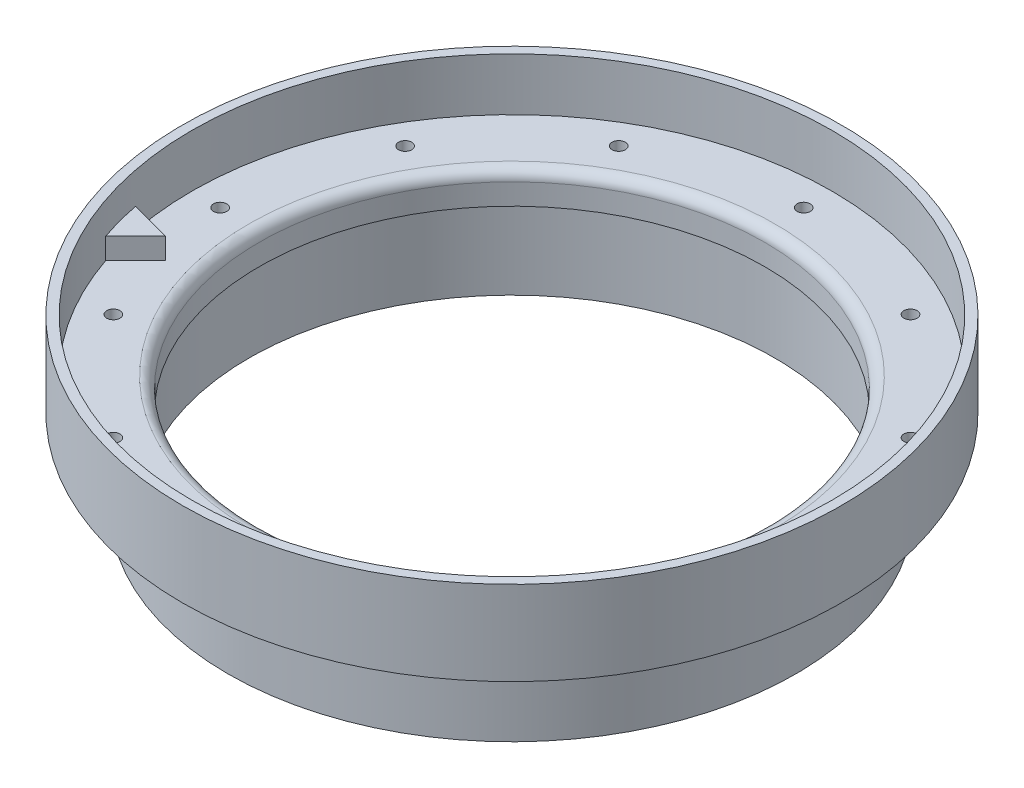
ISO-10303-21;
HEADER;
FILE_DESCRIPTION(('STEP AP214'),'2;1');
FILE_NAME('part.step','',(''),(''),'','','');
FILE_SCHEMA(('AUTOMOTIVE_DESIGN { 1 0 10303 214 1 1 1 1 }'));
ENDSEC;
DATA;
#1=APPLICATION_CONTEXT('core data for automotive mechanical design processes');
#2=APPLICATION_PROTOCOL_DEFINITION('international standard','automotive_design',2000,#1);
#3=PRODUCT_CONTEXT('',#1,'mechanical');
#4=PRODUCT('Part','Part','',(#3));
#5=PRODUCT_RELATED_PRODUCT_CATEGORY('part','',(#4));
#6=PRODUCT_DEFINITION_FORMATION('','',#4);
#7=PRODUCT_DEFINITION_CONTEXT('part definition',#1,'design');
#8=PRODUCT_DEFINITION('design','',#6,#7);
#9=PRODUCT_DEFINITION_SHAPE('','',#8);
#10=(LENGTH_UNIT() NAMED_UNIT(*) SI_UNIT(.MILLI.,.METRE.));
#11=(NAMED_UNIT(*) PLANE_ANGLE_UNIT() SI_UNIT($,.RADIAN.));
#12=(NAMED_UNIT(*) SI_UNIT($,.STERADIAN.) SOLID_ANGLE_UNIT());
#13=UNCERTAINTY_MEASURE_WITH_UNIT(LENGTH_MEASURE(1.E-05),#10,'distance_accuracy_value','');
#14=(GEOMETRIC_REPRESENTATION_CONTEXT(3) GLOBAL_UNCERTAINTY_ASSIGNED_CONTEXT((#13)) GLOBAL_UNIT_ASSIGNED_CONTEXT((#10,
#11,#12)) REPRESENTATION_CONTEXT('',''));
#15=CARTESIAN_POINT('',(0.,0.,0.));
#16=DIRECTION('',(0.,0.,1.));
#17=DIRECTION('',(1.,0.,0.));
#18=AXIS2_PLACEMENT_3D('',#15,#16,#17);
#19=CARTESIAN_POINT('',(0.,55.,0.));
#20=DIRECTION('',(0.,1.,0.));
#21=DIRECTION('',(0.,0.,1.));
#22=AXIS2_PLACEMENT_3D('',#19,#20,#21);
#23=CYLINDRICAL_SURFACE('',#22,48.26);
#24=CARTESIAN_POINT('',(0.,9.525,0.));
#25=DIRECTION('',(0.,1.,0.));
#26=DIRECTION('',(0.,0.,1.));
#27=AXIS2_PLACEMENT_3D('',#24,#25,#26);
#28=CIRCLE('',#27,48.26);
#29=CARTESIAN_POINT('',(0.,9.525,48.26));
#30=VERTEX_POINT('',#29);
#31=EDGE_CURVE('E173',#30,#30,#28,.T.);
#32=ORIENTED_EDGE('',*,*,#31,.T.);
#33=EDGE_LOOP('',(#32));
#34=FACE_BOUND('',#33,.T.);
#35=CARTESIAN_POINT('',(0.,1.5875,0.));
#36=DIRECTION('',(0.,1.,0.));
#37=DIRECTION('',(0.,0.,1.));
#38=AXIS2_PLACEMENT_3D('',#35,#36,#37);
#39=CIRCLE('',#38,48.26);
#40=CARTESIAN_POINT('',(-45.6928384549485,1.5875,15.5303610366912));
#41=VERTEX_POINT('',#40);
#42=CARTESIAN_POINT('',(-47.3363393913495,1.5875,9.3967320397557));
#43=VERTEX_POINT('',#42);
#44=EDGE_CURVE('E85',#41,#43,#39,.T.);
#45=ORIENTED_EDGE('',*,*,#44,.F.);
#46=DIRECTION('',(0.,-1.,0.));
#47=VECTOR('',#46,1.);
#48=CARTESIAN_POINT('',(-45.6928384549485,4.7625,15.5303610366912));
#49=LINE('',#48,#47);
#50=CARTESIAN_POINT('',(-45.6928384549485,4.7625,15.5303610366912));
#51=VERTEX_POINT('',#50);
#52=EDGE_CURVE('E75',#51,#41,#49,.T.);
#53=ORIENTED_EDGE('',*,*,#52,.F.);
#54=CARTESIAN_POINT('',(0.,4.7625,0.));
#55=DIRECTION('',(0.,1.,0.));
#56=DIRECTION('',(0.,0.,-1.));
#57=AXIS2_PLACEMENT_3D('',#54,#55,#56);
#58=CIRCLE('',#57,48.26);
#59=CARTESIAN_POINT('',(-47.3363393913495,4.7625,9.3967320397557));
#60=VERTEX_POINT('',#59);
#61=EDGE_CURVE('E77',#60,#51,#58,.T.);
#62=ORIENTED_EDGE('',*,*,#61,.F.);
#63=DIRECTION('',(0.,-1.,0.));
#64=VECTOR('',#63,1.);
#65=CARTESIAN_POINT('',(-47.3363393913495,4.7625,9.3967320397557));
#66=LINE('',#65,#64);
#67=EDGE_CURVE('E91',#60,#43,#66,.T.);
#68=ORIENTED_EDGE('',*,*,#67,.T.);
#69=EDGE_LOOP('',(#45,#53,#62,#68));
#70=FACE_BOUND('',#69,.T.);
#71=ADVANCED_FACE('F35',(#34,#70),#23,.F.);
#72=CARTESIAN_POINT('',(-39.6875,1.5875,0.));
#73=DIRECTION('',(0.,1.,0.));
#74=DIRECTION('',(0.,0.,1.));
#75=AXIS2_PLACEMENT_3D('',#72,#73,#74);
#76=PLANE('',#75);
#77=CARTESIAN_POINT('',(-38.0823845996807,1.58750000000002,-21.9868749999744));
#78=DIRECTION('',(0.,1.,0.));
#79=DIRECTION('',(0.,0.,1.));
#80=AXIS2_PLACEMENT_3D('',#77,#78,#79);
#81=CIRCLE('',#80,0.996949999999996);
#82=CARTESIAN_POINT('',(-38.0823845996807,1.58750000000002,-20.9899249999744));
#83=VERTEX_POINT('',#82);
#84=EDGE_CURVE('E86',#83,#83,#81,.T.);
#85=ORIENTED_EDGE('',*,*,#84,.F.);
#86=EDGE_LOOP('',(#85));
#87=FACE_BOUND('',#86,.T.);
#88=CARTESIAN_POINT('',(-21.9868750000255,1.58750000000007,-38.0823845996512));
#89=DIRECTION('',(0.,1.,0.));
#90=DIRECTION('',(0.,0.,1.));
#91=AXIS2_PLACEMENT_3D('',#88,#89,#90);
#92=CIRCLE('',#91,0.996949999999996);
#93=CARTESIAN_POINT('',(-21.9868750000255,1.58750000000007,-37.0854345996512));
#94=VERTEX_POINT('',#93);
#95=EDGE_CURVE('E97',#94,#94,#92,.T.);
#96=ORIENTED_EDGE('',*,*,#95,.F.);
#97=EDGE_LOOP('',(#96));
#98=FACE_BOUND('',#97,.T.);
#99=CARTESIAN_POINT('',(-2.94188747273289E-11,1.58750000000015,-43.97375));
#100=DIRECTION('',(0.,1.,0.));
#101=DIRECTION('',(0.,0.,1.));
#102=AXIS2_PLACEMENT_3D('',#99,#100,#101);
#103=CIRCLE('',#102,0.996949999999998);
#104=CARTESIAN_POINT('',(-2.94188747273289E-11,1.58750000000015,-42.9768));
#105=VERTEX_POINT('',#104);
#106=EDGE_CURVE('E103',#105,#105,#103,.T.);
#107=ORIENTED_EDGE('',*,*,#106,.F.);
#108=EDGE_LOOP('',(#107));
#109=FACE_BOUND('',#108,.T.);
#110=CARTESIAN_POINT('',(21.9868749999745,1.58750000000023,-38.0823845996806));
#111=DIRECTION('',(0.,1.,0.));
#112=DIRECTION('',(0.,0.,1.));
#113=AXIS2_PLACEMENT_3D('',#110,#111,#112);
#114=CIRCLE('',#113,0.996949999999996);
#115=CARTESIAN_POINT('',(21.9868749999745,1.58750000000023,-37.0854345996806));
#116=VERTEX_POINT('',#115);
#117=EDGE_CURVE('E109',#116,#116,#114,.T.);
#118=ORIENTED_EDGE('',*,*,#117,.F.);
#119=EDGE_LOOP('',(#118));
#120=FACE_BOUND('',#119,.T.);
#121=CARTESIAN_POINT('',(38.0823845996513,1.58750000000028,-21.9868750000254));
#122=DIRECTION('',(0.,1.,0.));
#123=DIRECTION('',(0.,0.,1.));
#124=AXIS2_PLACEMENT_3D('',#121,#122,#123);
#125=CIRCLE('',#124,0.996949999999996);
#126=CARTESIAN_POINT('',(38.0823845996513,1.58750000000028,-20.9899250000254));
#127=VERTEX_POINT('',#126);
#128=EDGE_CURVE('E115',#127,#127,#125,.T.);
#129=ORIENTED_EDGE('',*,*,#128,.F.);
#130=EDGE_LOOP('',(#129));
#131=FACE_BOUND('',#130,.T.);
#132=CARTESIAN_POINT('',(43.97375,1.58750000000031,-2.89527314181316E-11));
#133=DIRECTION('',(0.,1.,0.));
#134=DIRECTION('',(0.,0.,1.));
#135=AXIS2_PLACEMENT_3D('',#132,#133,#134);
#136=CIRCLE('',#135,0.996949999999996);
#137=CARTESIAN_POINT('',(43.97375,1.58750000000031,0.996949999971044));
#138=VERTEX_POINT('',#137);
#139=EDGE_CURVE('E121',#138,#138,#136,.T.);
#140=ORIENTED_EDGE('',*,*,#139,.F.);
#141=EDGE_LOOP('',(#140));
#142=FACE_BOUND('',#141,.T.);
#143=CARTESIAN_POINT('',(38.0823845996805,1.58750000000028,21.9868749999747));
#144=DIRECTION('',(0.,1.,0.));
#145=DIRECTION('',(0.,0.,1.));
#146=AXIS2_PLACEMENT_3D('',#143,#144,#145);
#147=CIRCLE('',#146,0.996949999999996);
#148=CARTESIAN_POINT('',(38.0823845996805,1.58750000000029,22.9838249999747));
#149=VERTEX_POINT('',#148);
#150=EDGE_CURVE('E127',#149,#149,#147,.T.);
#151=ORIENTED_EDGE('',*,*,#150,.F.);
#152=EDGE_LOOP('',(#151));
#153=FACE_BOUND('',#152,.T.);
#154=CARTESIAN_POINT('',(21.9868750000252,1.58750000000023,38.0823845996514));
#155=DIRECTION('',(0.,1.,0.));
#156=DIRECTION('',(0.,0.,1.));
#157=AXIS2_PLACEMENT_3D('',#154,#155,#156);
#158=CIRCLE('',#157,0.996949999999996);
#159=CARTESIAN_POINT('',(21.9868750000252,1.58750000000023,39.0793345996514));
#160=VERTEX_POINT('',#159);
#161=EDGE_CURVE('E133',#160,#160,#158,.T.);
#162=ORIENTED_EDGE('',*,*,#161,.F.);
#163=EDGE_LOOP('',(#162));
#164=FACE_BOUND('',#163,.T.);
#165=CARTESIAN_POINT('',(2.91007222190302E-11,1.58750000000015,43.97375));
#166=DIRECTION('',(0.,1.,0.));
#167=DIRECTION('',(0.,0.,1.));
#168=AXIS2_PLACEMENT_3D('',#165,#166,#167);
#169=CIRCLE('',#168,0.996949999999998);
#170=CARTESIAN_POINT('',(2.91007222190302E-11,1.58750000000015,44.9707));
#171=VERTEX_POINT('',#170);
#172=EDGE_CURVE('E139',#171,#171,#169,.T.);
#173=ORIENTED_EDGE('',*,*,#172,.F.);
#174=EDGE_LOOP('',(#173));
#175=FACE_BOUND('',#174,.T.);
#176=CARTESIAN_POINT('',(-21.9868749999748,1.58750000000007,38.0823845996805));
#177=DIRECTION('',(0.,1.,0.));
#178=DIRECTION('',(0.,0.,1.));
#179=AXIS2_PLACEMENT_3D('',#176,#177,#178);
#180=CIRCLE('',#179,0.996949999999996);
#181=CARTESIAN_POINT('',(-21.9868749999748,1.58750000000008,39.0793345996805));
#182=VERTEX_POINT('',#181);
#183=EDGE_CURVE('E145',#182,#182,#180,.T.);
#184=ORIENTED_EDGE('',*,*,#183,.F.);
#185=EDGE_LOOP('',(#184));
#186=FACE_BOUND('',#185,.T.);
#187=CARTESIAN_POINT('',(-38.0823845996514,1.58750000000002,21.9868750000251));
#188=DIRECTION('',(0.,1.,0.));
#189=DIRECTION('',(0.,0.,1.));
#190=AXIS2_PLACEMENT_3D('',#187,#188,#189);
#191=CIRCLE('',#190,0.996949999999996);
#192=CARTESIAN_POINT('',(-38.0823845996514,1.58750000000002,22.9838250000251));
#193=VERTEX_POINT('',#192);
#194=EDGE_CURVE('E151',#193,#193,#191,.T.);
#195=ORIENTED_EDGE('',*,*,#194,.F.);
#196=EDGE_LOOP('',(#195));
#197=FACE_BOUND('',#196,.T.);
#198=CARTESIAN_POINT('',(-43.97375,1.5875,2.89527314181316E-11));
#199=DIRECTION('',(0.,1.,0.));
#200=DIRECTION('',(0.,0.,1.));
#201=AXIS2_PLACEMENT_3D('',#198,#199,#200);
#202=CIRCLE('',#201,0.996949999999996);
#203=CARTESIAN_POINT('',(-43.97375,1.5875,0.996950000028949));
#204=VERTEX_POINT('',#203);
#205=EDGE_CURVE('E157',#204,#204,#202,.T.);
#206=ORIENTED_EDGE('',*,*,#205,.F.);
#207=EDGE_LOOP('',(#206));
#208=FACE_BOUND('',#207,.T.);
#209=CARTESIAN_POINT('',(0.,1.5875,0.));
#210=DIRECTION('',(0.,1.,0.));
#211=DIRECTION('',(0.,0.,1.));
#212=AXIS2_PLACEMENT_3D('',#209,#210,#211);
#213=CIRCLE('',#212,39.6875);
#214=CARTESIAN_POINT('',(0.,1.5875,39.6875));
#215=VERTEX_POINT('',#214);
#216=EDGE_CURVE('E169',#215,#215,#213,.T.);
#217=ORIENTED_EDGE('',*,*,#216,.F.);
#218=EDGE_LOOP('',(#217));
#219=FACE_BOUND('',#218,.T.);
#220=DIRECTION('',(-0.965925826289069,0.,-0.258819045102517));
#221=VECTOR('',#220,1.);
#222=CARTESIAN_POINT('',(-41.2027103944139,1.5875,11.0402329761567));
#223=LINE('',#222,#221);
#224=CARTESIAN_POINT('',(-41.2027103944139,1.5875,11.0402329761567));
#225=VERTEX_POINT('',#224);
#226=EDGE_CURVE('E68',#225,#43,#223,.T.);
#227=ORIENTED_EDGE('',*,*,#226,.F.);
#228=DIRECTION('',(0.707106781186549,0.,-0.707106781186546));
#229=VECTOR('',#228,1.);
#230=CARTESIAN_POINT('',(-45.6928384549485,1.5875,15.5303610366912));
#231=LINE('',#230,#229);
#232=EDGE_CURVE('E504',#41,#225,#231,.T.);
#233=ORIENTED_EDGE('',*,*,#232,.F.);
#234=ORIENTED_EDGE('',*,*,#44,.T.);
#235=EDGE_LOOP('',(#227,#233,#234));
#236=FACE_BOUND('',#235,.T.);
#237=ADVANCED_FACE('F202',(#87,#98,#109,#120,#131,#142,#153,#164,#175,#186,#197,#208,#219,#236),
#76,.T.);
#238=CARTESIAN_POINT('',(-38.1,-3.175,0.));
#239=DIRECTION('',(0.,-1.,0.));
#240=DIRECTION('',(0.,0.,-1.));
#241=AXIS2_PLACEMENT_3D('',#238,#239,#240);
#242=PLANE('',#241);
#243=CARTESIAN_POINT('',(0.,-3.175,0.));
#244=DIRECTION('',(0.,1.,0.));
#245=DIRECTION('',(0.,0.,1.));
#246=AXIS2_PLACEMENT_3D('',#243,#244,#245);
#247=CIRCLE('',#246,38.1);
#248=CARTESIAN_POINT('',(0.,-3.175,38.1));
#249=VERTEX_POINT('',#248);
#250=EDGE_CURVE('E163',#249,#249,#247,.T.);
#251=ORIENTED_EDGE('',*,*,#250,.T.);
#252=EDGE_LOOP('',(#251));
#253=FACE_BOUND('',#252,.T.);
#254=CARTESIAN_POINT('',(0.,-3.175,0.));
#255=DIRECTION('',(0.,1.,0.));
#256=DIRECTION('',(0.,0.,1.));
#257=AXIS2_PLACEMENT_3D('',#254,#255,#256);
#258=CIRCLE('',#257,39.6367);
#259=CARTESIAN_POINT('',(0.,-3.175,39.6367));
#260=VERTEX_POINT('',#259);
#261=EDGE_CURVE('E11',#260,#260,#258,.T.);
#262=ORIENTED_EDGE('',*,*,#261,.F.);
#263=EDGE_LOOP('',(#262));
#264=FACE_BOUND('',#263,.T.);
#265=ADVANCED_FACE('F37',(#253,#264),#242,.T.);
#266=CARTESIAN_POINT('',(0.,55.,0.));
#267=DIRECTION('',(0.,1.,0.));
#268=DIRECTION('',(0.,0.,1.));
#269=AXIS2_PLACEMENT_3D('',#266,#267,#268);
#270=CYLINDRICAL_SURFACE('',#269,39.6367);
#271=ORIENTED_EDGE('',*,*,#261,.T.);
#272=EDGE_LOOP('',(#271));
#273=FACE_BOUND('',#272,.T.);
#274=CARTESIAN_POINT('',(0.,-15.875,0.));
#275=DIRECTION('',(0.,1.,0.));
#276=DIRECTION('',(0.,0.,1.));
#277=AXIS2_PLACEMENT_3D('',#274,#275,#276);
#278=CIRCLE('',#277,39.6367);
#279=CARTESIAN_POINT('',(0.,-15.875,39.6367));
#280=VERTEX_POINT('',#279);
#281=EDGE_CURVE('E43',#280,#280,#278,.T.);
#282=ORIENTED_EDGE('',*,*,#281,.F.);
#283=EDGE_LOOP('',(#282));
#284=FACE_BOUND('',#283,.T.);
#285=ADVANCED_FACE('F193',(#273,#284),#270,.F.);
#286=CARTESIAN_POINT('',(-42.8117,-15.875,0.));
#287=DIRECTION('',(0.,-1.,0.));
#288=DIRECTION('',(0.,0.,-1.));
#289=AXIS2_PLACEMENT_3D('',#286,#287,#288);
#290=PLANE('',#289);
#291=ORIENTED_EDGE('',*,*,#281,.T.);
#292=EDGE_LOOP('',(#291));
#293=FACE_BOUND('',#292,.T.);
#294=CARTESIAN_POINT('',(0.,-15.875,0.));
#295=DIRECTION('',(0.,1.,0.));
#296=DIRECTION('',(0.,0.,1.));
#297=AXIS2_PLACEMENT_3D('',#294,#295,#296);
#298=CIRCLE('',#297,42.8117);
#299=CARTESIAN_POINT('',(0.,-15.875,42.8117));
#300=VERTEX_POINT('',#299);
#301=EDGE_CURVE('E185',#300,#300,#298,.T.);
#302=ORIENTED_EDGE('',*,*,#301,.F.);
#303=EDGE_LOOP('',(#302));
#304=FACE_BOUND('',#303,.T.);
#305=ADVANCED_FACE('F190',(#293,#304),#290,.T.);
#306=CARTESIAN_POINT('',(0.,55.,0.));
#307=DIRECTION('',(0.,1.,0.));
#308=DIRECTION('',(0.,0.,1.));
#309=AXIS2_PLACEMENT_3D('',#306,#307,#308);
#310=CYLINDRICAL_SURFACE('',#309,42.8117);
#311=ORIENTED_EDGE('',*,*,#301,.T.);
#312=EDGE_LOOP('',(#311));
#313=FACE_BOUND('',#312,.T.);
#314=CARTESIAN_POINT('',(0.,-3.175,0.));
#315=DIRECTION('',(0.,1.,0.));
#316=DIRECTION('',(0.,0.,1.));
#317=AXIS2_PLACEMENT_3D('',#314,#315,#316);
#318=CIRCLE('',#317,42.8117);
#319=CARTESIAN_POINT('',(0.,-3.175,42.8117));
#320=VERTEX_POINT('',#319);
#321=EDGE_CURVE('E182',#320,#320,#318,.T.);
#322=ORIENTED_EDGE('',*,*,#321,.F.);
#323=EDGE_LOOP('',(#322));
#324=FACE_BOUND('',#323,.T.);
#325=ADVANCED_FACE('F200',(#313,#324),#310,.T.);
#326=CARTESIAN_POINT('',(-42.8117,-3.175,0.));
#327=DIRECTION('',(0.,-1.,0.));
#328=DIRECTION('',(0.,0.,-1.));
#329=AXIS2_PLACEMENT_3D('',#326,#327,#328);
#330=PLANE('',#329);
#331=CARTESIAN_POINT('',(-38.0823845996807,-3.175,-21.9868749999744));
#332=DIRECTION('',(0.,-1.,0.));
#333=DIRECTION('',(0.,0.,-1.));
#334=AXIS2_PLACEMENT_3D('',#331,#332,#333);
#335=CIRCLE('',#334,0.996949999999996);
#336=CARTESIAN_POINT('',(-38.0823845996807,-3.175,-22.9838249999744));
#337=VERTEX_POINT('',#336);
#338=EDGE_CURVE('E89',#337,#337,#335,.T.);
#339=ORIENTED_EDGE('',*,*,#338,.F.);
#340=EDGE_LOOP('',(#339));
#341=FACE_BOUND('',#340,.T.);
#342=CARTESIAN_POINT('',(-21.9868750000255,-3.175,-38.0823845996512));
#343=DIRECTION('',(0.,-1.,0.));
#344=DIRECTION('',(0.,0.,-1.));
#345=AXIS2_PLACEMENT_3D('',#342,#343,#344);
#346=CIRCLE('',#345,0.996949999999996);
#347=CARTESIAN_POINT('',(-21.9868750000255,-3.175,-39.0793345996512));
#348=VERTEX_POINT('',#347);
#349=EDGE_CURVE('E100',#348,#348,#346,.T.);
#350=ORIENTED_EDGE('',*,*,#349,.F.);
#351=EDGE_LOOP('',(#350));
#352=FACE_BOUND('',#351,.T.);
#353=CARTESIAN_POINT('',(-2.94188747273289E-11,-3.175,-43.97375));
#354=DIRECTION('',(0.,-1.,0.));
#355=DIRECTION('',(0.,0.,-1.));
#356=AXIS2_PLACEMENT_3D('',#353,#354,#355);
#357=CIRCLE('',#356,0.996949999999996);
#358=CARTESIAN_POINT('',(-2.94188747273289E-11,-3.175,-44.9707));
#359=VERTEX_POINT('',#358);
#360=EDGE_CURVE('E106',#359,#359,#357,.T.);
#361=ORIENTED_EDGE('',*,*,#360,.F.);
#362=EDGE_LOOP('',(#361));
#363=FACE_BOUND('',#362,.T.);
#364=CARTESIAN_POINT('',(21.9868749999745,-3.175,-38.0823845996806));
#365=DIRECTION('',(0.,-1.,0.));
#366=DIRECTION('',(0.,0.,-1.));
#367=AXIS2_PLACEMENT_3D('',#364,#365,#366);
#368=CIRCLE('',#367,0.996949999999996);
#369=CARTESIAN_POINT('',(21.9868749999745,-3.175,-39.0793345996806));
#370=VERTEX_POINT('',#369);
#371=EDGE_CURVE('E112',#370,#370,#368,.T.);
#372=ORIENTED_EDGE('',*,*,#371,.F.);
#373=EDGE_LOOP('',(#372));
#374=FACE_BOUND('',#373,.T.);
#375=CARTESIAN_POINT('',(38.0823845996513,-3.175,-21.9868750000254));
#376=DIRECTION('',(0.,-1.,0.));
#377=DIRECTION('',(0.,0.,-1.));
#378=AXIS2_PLACEMENT_3D('',#375,#376,#377);
#379=CIRCLE('',#378,0.996949999999996);
#380=CARTESIAN_POINT('',(38.0823845996513,-3.175,-22.9838250000254));
#381=VERTEX_POINT('',#380);
#382=EDGE_CURVE('E118',#381,#381,#379,.T.);
#383=ORIENTED_EDGE('',*,*,#382,.F.);
#384=EDGE_LOOP('',(#383));
#385=FACE_BOUND('',#384,.T.);
#386=CARTESIAN_POINT('',(43.97375,-3.175,-2.89527314181316E-11));
#387=DIRECTION('',(0.,-1.,0.));
#388=DIRECTION('',(0.,0.,-1.));
#389=AXIS2_PLACEMENT_3D('',#386,#387,#388);
#390=CIRCLE('',#389,0.996949999999996);
#391=CARTESIAN_POINT('',(43.97375,-3.175,-0.996950000028949));
#392=VERTEX_POINT('',#391);
#393=EDGE_CURVE('E124',#392,#392,#390,.T.);
#394=ORIENTED_EDGE('',*,*,#393,.F.);
#395=EDGE_LOOP('',(#394));
#396=FACE_BOUND('',#395,.T.);
#397=CARTESIAN_POINT('',(38.0823845996805,-3.175,21.9868749999747));
#398=DIRECTION('',(0.,-1.,0.));
#399=DIRECTION('',(0.,0.,-1.));
#400=AXIS2_PLACEMENT_3D('',#397,#398,#399);
#401=CIRCLE('',#400,0.996949999999996);
#402=CARTESIAN_POINT('',(38.0823845996805,-3.175,20.9899249999747));
#403=VERTEX_POINT('',#402);
#404=EDGE_CURVE('E130',#403,#403,#401,.T.);
#405=ORIENTED_EDGE('',*,*,#404,.F.);
#406=EDGE_LOOP('',(#405));
#407=FACE_BOUND('',#406,.T.);
#408=CARTESIAN_POINT('',(21.9868750000252,-3.175,38.0823845996514));
#409=DIRECTION('',(0.,-1.,0.));
#410=DIRECTION('',(0.,0.,-1.));
#411=AXIS2_PLACEMENT_3D('',#408,#409,#410);
#412=CIRCLE('',#411,0.996949999999996);
#413=CARTESIAN_POINT('',(21.9868750000252,-3.175,37.0854345996514));
#414=VERTEX_POINT('',#413);
#415=EDGE_CURVE('E136',#414,#414,#412,.T.);
#416=ORIENTED_EDGE('',*,*,#415,.F.);
#417=EDGE_LOOP('',(#416));
#418=FACE_BOUND('',#417,.T.);
#419=CARTESIAN_POINT('',(2.91007222190302E-11,-3.175,43.97375));
#420=DIRECTION('',(0.,-1.,0.));
#421=DIRECTION('',(0.,0.,-1.));
#422=AXIS2_PLACEMENT_3D('',#419,#420,#421);
#423=CIRCLE('',#422,0.996949999999996);
#424=CARTESIAN_POINT('',(2.91007222190302E-11,-3.175,42.9768));
#425=VERTEX_POINT('',#424);
#426=EDGE_CURVE('E142',#425,#425,#423,.T.);
#427=ORIENTED_EDGE('',*,*,#426,.F.);
#428=EDGE_LOOP('',(#427));
#429=FACE_BOUND('',#428,.T.);
#430=CARTESIAN_POINT('',(-21.9868749999748,-3.175,38.0823845996805));
#431=DIRECTION('',(0.,-1.,0.));
#432=DIRECTION('',(0.,0.,-1.));
#433=AXIS2_PLACEMENT_3D('',#430,#431,#432);
#434=CIRCLE('',#433,0.996949999999996);
#435=CARTESIAN_POINT('',(-21.9868749999748,-3.175,37.0854345996805));
#436=VERTEX_POINT('',#435);
#437=EDGE_CURVE('E148',#436,#436,#434,.T.);
#438=ORIENTED_EDGE('',*,*,#437,.F.);
#439=EDGE_LOOP('',(#438));
#440=FACE_BOUND('',#439,.T.);
#441=CARTESIAN_POINT('',(-38.0823845996514,-3.175,21.9868750000251));
#442=DIRECTION('',(0.,-1.,0.));
#443=DIRECTION('',(0.,0.,-1.));
#444=AXIS2_PLACEMENT_3D('',#441,#442,#443);
#445=CIRCLE('',#444,0.996949999999996);
#446=CARTESIAN_POINT('',(-38.0823845996514,-3.175,20.9899250000251));
#447=VERTEX_POINT('',#446);
#448=EDGE_CURVE('E154',#447,#447,#445,.T.);
#449=ORIENTED_EDGE('',*,*,#448,.F.);
#450=EDGE_LOOP('',(#449));
#451=FACE_BOUND('',#450,.T.);
#452=CARTESIAN_POINT('',(-43.97375,-3.175,2.89527314181316E-11));
#453=DIRECTION('',(0.,-1.,0.));
#454=DIRECTION('',(0.,0.,-1.));
#455=AXIS2_PLACEMENT_3D('',#452,#453,#454);
#456=CIRCLE('',#455,0.996949999999996);
#457=CARTESIAN_POINT('',(-43.97375,-3.175,-0.996949999971044));
#458=VERTEX_POINT('',#457);
#459=EDGE_CURVE('E160',#458,#458,#456,.T.);
#460=ORIENTED_EDGE('',*,*,#459,.F.);
#461=EDGE_LOOP('',(#460));
#462=FACE_BOUND('',#461,.T.);
#463=ORIENTED_EDGE('',*,*,#321,.T.);
#464=EDGE_LOOP('',(#463));
#465=FACE_BOUND('',#464,.T.);
#466=CARTESIAN_POINT('',(0.,-3.175,0.));
#467=DIRECTION('',(0.,1.,0.));
#468=DIRECTION('',(0.,0.,1.));
#469=AXIS2_PLACEMENT_3D('',#466,#467,#468);
#470=CIRCLE('',#469,49.6697);
#471=CARTESIAN_POINT('',(0.,-3.175,49.6697));
#472=VERTEX_POINT('',#471);
#473=EDGE_CURVE('E179',#472,#472,#470,.T.);
#474=ORIENTED_EDGE('',*,*,#473,.F.);
#475=EDGE_LOOP('',(#474));
#476=FACE_BOUND('',#475,.T.);
#477=ADVANCED_FACE('F222',(#341,#352,#363,#374,#385,#396,#407,#418,#429,#440,#451,#462,#465,
#476),#330,.T.);
#478=CARTESIAN_POINT('',(0.,55.,0.));
#479=DIRECTION('',(0.,1.,0.));
#480=DIRECTION('',(0.,0.,1.));
#481=AXIS2_PLACEMENT_3D('',#478,#479,#480);
#482=CYLINDRICAL_SURFACE('',#481,49.6697);
#483=ORIENTED_EDGE('',*,*,#473,.T.);
#484=EDGE_LOOP('',(#483));
#485=FACE_BOUND('',#484,.T.);
#486=CARTESIAN_POINT('',(0.,9.525,0.));
#487=DIRECTION('',(0.,1.,0.));
#488=DIRECTION('',(0.,0.,1.));
#489=AXIS2_PLACEMENT_3D('',#486,#487,#488);
#490=CIRCLE('',#489,49.6697);
#491=CARTESIAN_POINT('',(0.,9.525,49.6697));
#492=VERTEX_POINT('',#491);
#493=EDGE_CURVE('E176',#492,#492,#490,.T.);
#494=ORIENTED_EDGE('',*,*,#493,.F.);
#495=EDGE_LOOP('',(#494));
#496=FACE_BOUND('',#495,.T.);
#497=ADVANCED_FACE('F218',(#485,#496),#482,.T.);
#498=CARTESIAN_POINT('',(-49.6697,9.525,0.));
#499=DIRECTION('',(0.,1.,0.));
#500=DIRECTION('',(0.,0.,1.));
#501=AXIS2_PLACEMENT_3D('',#498,#499,#500);
#502=PLANE('',#501);
#503=ORIENTED_EDGE('',*,*,#493,.T.);
#504=EDGE_LOOP('',(#503));
#505=FACE_BOUND('',#504,.T.);
#506=ORIENTED_EDGE('',*,*,#31,.F.);
#507=EDGE_LOOP('',(#506));
#508=FACE_BOUND('',#507,.T.);
#509=ADVANCED_FACE('F214',(#505,#508),#502,.T.);
#510=CARTESIAN_POINT('',(0.,0.,0.));
#511=DIRECTION('',(0.,1.,0.));
#512=DIRECTION('',(0.,0.,1.));
#513=AXIS2_PLACEMENT_3D('',#510,#511,#512);
#514=TOROIDAL_SURFACE('',#513,39.6875,1.5875);
#515=ORIENTED_EDGE('',*,*,#216,.T.);
#516=EDGE_LOOP('',(#515));
#517=FACE_BOUND('',#516,.T.);
#518=CARTESIAN_POINT('',(0.,0.,0.));
#519=DIRECTION('',(0.,1.,0.));
#520=DIRECTION('',(0.,0.,1.));
#521=AXIS2_PLACEMENT_3D('',#518,#519,#520);
#522=CIRCLE('',#521,38.1);
#523=CARTESIAN_POINT('',(0.,0.,38.1));
#524=VERTEX_POINT('',#523);
#525=EDGE_CURVE('E166',#524,#524,#522,.T.);
#526=ORIENTED_EDGE('',*,*,#525,.F.);
#527=EDGE_LOOP('',(#526));
#528=FACE_BOUND('',#527,.T.);
#529=ADVANCED_FACE('F217',(#517,#528),#514,.T.);
#530=CARTESIAN_POINT('',(0.,55.,0.));
#531=DIRECTION('',(0.,1.,0.));
#532=DIRECTION('',(0.,0.,1.));
#533=AXIS2_PLACEMENT_3D('',#530,#531,#532);
#534=CYLINDRICAL_SURFACE('',#533,38.1);
#535=ORIENTED_EDGE('',*,*,#525,.T.);
#536=EDGE_LOOP('',(#535));
#537=FACE_BOUND('',#536,.T.);
#538=ORIENTED_EDGE('',*,*,#250,.F.);
#539=EDGE_LOOP('',(#538));
#540=FACE_BOUND('',#539,.T.);
#541=ADVANCED_FACE('F263',(#537,#540),#534,.F.);
#542=CARTESIAN_POINT('',(-43.97375,1.5875,2.89527314181316E-11));
#543=DIRECTION('',(0.,1.,0.));
#544=DIRECTION('',(0.,0.,1.));
#545=AXIS2_PLACEMENT_3D('',#542,#543,#544);
#546=CYLINDRICAL_SURFACE('',#545,0.996949999999996);
#547=ORIENTED_EDGE('',*,*,#459,.T.);
#548=EDGE_LOOP('',(#547));
#549=FACE_BOUND('',#548,.T.);
#550=ORIENTED_EDGE('',*,*,#205,.T.);
#551=EDGE_LOOP('',(#550));
#552=FACE_BOUND('',#551,.T.);
#553=ADVANCED_FACE('F270',(#549,#552),#546,.F.);
#554=CARTESIAN_POINT('',(-38.0823845996514,1.58750000000002,21.9868750000251));
#555=DIRECTION('',(0.,1.,0.));
#556=DIRECTION('',(0.,0.,1.));
#557=AXIS2_PLACEMENT_3D('',#554,#555,#556);
#558=CYLINDRICAL_SURFACE('',#557,0.996949999999996);
#559=ORIENTED_EDGE('',*,*,#448,.T.);
#560=EDGE_LOOP('',(#559));
#561=FACE_BOUND('',#560,.T.);
#562=ORIENTED_EDGE('',*,*,#194,.T.);
#563=EDGE_LOOP('',(#562));
#564=FACE_BOUND('',#563,.T.);
#565=ADVANCED_FACE('F278',(#561,#564),#558,.F.);
#566=CARTESIAN_POINT('',(-21.9868749999748,1.58750000000007,38.0823845996805));
#567=DIRECTION('',(0.,1.,0.));
#568=DIRECTION('',(0.,0.,1.));
#569=AXIS2_PLACEMENT_3D('',#566,#567,#568);
#570=CYLINDRICAL_SURFACE('',#569,0.996949999999996);
#571=ORIENTED_EDGE('',*,*,#437,.T.);
#572=EDGE_LOOP('',(#571));
#573=FACE_BOUND('',#572,.T.);
#574=ORIENTED_EDGE('',*,*,#183,.T.);
#575=EDGE_LOOP('',(#574));
#576=FACE_BOUND('',#575,.T.);
#577=ADVANCED_FACE('F286',(#573,#576),#570,.F.);
#578=CARTESIAN_POINT('',(2.91007222190302E-11,1.58750000000015,43.97375));
#579=DIRECTION('',(0.,1.,0.));
#580=DIRECTION('',(0.,0.,1.));
#581=AXIS2_PLACEMENT_3D('',#578,#579,#580);
#582=CYLINDRICAL_SURFACE('',#581,0.996949999999996);
#583=ORIENTED_EDGE('',*,*,#426,.T.);
#584=EDGE_LOOP('',(#583));
#585=FACE_BOUND('',#584,.T.);
#586=ORIENTED_EDGE('',*,*,#172,.T.);
#587=EDGE_LOOP('',(#586));
#588=FACE_BOUND('',#587,.T.);
#589=ADVANCED_FACE('F294',(#585,#588),#582,.F.);
#590=CARTESIAN_POINT('',(21.9868750000252,1.58750000000023,38.0823845996514));
#591=DIRECTION('',(0.,1.,0.));
#592=DIRECTION('',(0.,0.,1.));
#593=AXIS2_PLACEMENT_3D('',#590,#591,#592);
#594=CYLINDRICAL_SURFACE('',#593,0.996949999999996);
#595=ORIENTED_EDGE('',*,*,#415,.T.);
#596=EDGE_LOOP('',(#595));
#597=FACE_BOUND('',#596,.T.);
#598=ORIENTED_EDGE('',*,*,#161,.T.);
#599=EDGE_LOOP('',(#598));
#600=FACE_BOUND('',#599,.T.);
#601=ADVANCED_FACE('F304',(#597,#600),#594,.F.);
#602=CARTESIAN_POINT('',(38.0823845996805,1.58750000000028,21.9868749999747));
#603=DIRECTION('',(0.,1.,0.));
#604=DIRECTION('',(0.,0.,1.));
#605=AXIS2_PLACEMENT_3D('',#602,#603,#604);
#606=CYLINDRICAL_SURFACE('',#605,0.996949999999996);
#607=ORIENTED_EDGE('',*,*,#404,.T.);
#608=EDGE_LOOP('',(#607));
#609=FACE_BOUND('',#608,.T.);
#610=ORIENTED_EDGE('',*,*,#150,.T.);
#611=EDGE_LOOP('',(#610));
#612=FACE_BOUND('',#611,.T.);
#613=ADVANCED_FACE('F313',(#609,#612),#606,.F.);
#614=CARTESIAN_POINT('',(43.97375,1.58750000000031,-2.89527314181316E-11));
#615=DIRECTION('',(0.,1.,0.));
#616=DIRECTION('',(0.,0.,1.));
#617=AXIS2_PLACEMENT_3D('',#614,#615,#616);
#618=CYLINDRICAL_SURFACE('',#617,0.996949999999996);
#619=ORIENTED_EDGE('',*,*,#393,.T.);
#620=EDGE_LOOP('',(#619));
#621=FACE_BOUND('',#620,.T.);
#622=ORIENTED_EDGE('',*,*,#139,.T.);
#623=EDGE_LOOP('',(#622));
#624=FACE_BOUND('',#623,.T.);
#625=ADVANCED_FACE('F322',(#621,#624),#618,.F.);
#626=CARTESIAN_POINT('',(38.0823845996513,1.58750000000028,-21.9868750000254));
#627=DIRECTION('',(0.,1.,0.));
#628=DIRECTION('',(0.,0.,1.));
#629=AXIS2_PLACEMENT_3D('',#626,#627,#628);
#630=CYLINDRICAL_SURFACE('',#629,0.996949999999996);
#631=ORIENTED_EDGE('',*,*,#382,.T.);
#632=EDGE_LOOP('',(#631));
#633=FACE_BOUND('',#632,.T.);
#634=ORIENTED_EDGE('',*,*,#128,.T.);
#635=EDGE_LOOP('',(#634));
#636=FACE_BOUND('',#635,.T.);
#637=ADVANCED_FACE('F329',(#633,#636),#630,.F.);
#638=CARTESIAN_POINT('',(21.9868749999745,1.58750000000023,-38.0823845996806));
#639=DIRECTION('',(0.,1.,0.));
#640=DIRECTION('',(0.,0.,1.));
#641=AXIS2_PLACEMENT_3D('',#638,#639,#640);
#642=CYLINDRICAL_SURFACE('',#641,0.996949999999996);
#643=ORIENTED_EDGE('',*,*,#371,.T.);
#644=EDGE_LOOP('',(#643));
#645=FACE_BOUND('',#644,.T.);
#646=ORIENTED_EDGE('',*,*,#117,.T.);
#647=EDGE_LOOP('',(#646));
#648=FACE_BOUND('',#647,.T.);
#649=ADVANCED_FACE('F336',(#645,#648),#642,.F.);
#650=CARTESIAN_POINT('',(-2.94188747273289E-11,1.58750000000015,-43.97375));
#651=DIRECTION('',(0.,1.,0.));
#652=DIRECTION('',(0.,0.,1.));
#653=AXIS2_PLACEMENT_3D('',#650,#651,#652);
#654=CYLINDRICAL_SURFACE('',#653,0.996949999999996);
#655=ORIENTED_EDGE('',*,*,#360,.T.);
#656=EDGE_LOOP('',(#655));
#657=FACE_BOUND('',#656,.T.);
#658=ORIENTED_EDGE('',*,*,#106,.T.);
#659=EDGE_LOOP('',(#658));
#660=FACE_BOUND('',#659,.T.);
#661=ADVANCED_FACE('F343',(#657,#660),#654,.F.);
#662=CARTESIAN_POINT('',(-21.9868750000255,1.58750000000007,-38.0823845996512));
#663=DIRECTION('',(0.,1.,0.));
#664=DIRECTION('',(0.,0.,1.));
#665=AXIS2_PLACEMENT_3D('',#662,#663,#664);
#666=CYLINDRICAL_SURFACE('',#665,0.996949999999996);
#667=ORIENTED_EDGE('',*,*,#349,.T.);
#668=EDGE_LOOP('',(#667));
#669=FACE_BOUND('',#668,.T.);
#670=ORIENTED_EDGE('',*,*,#95,.T.);
#671=EDGE_LOOP('',(#670));
#672=FACE_BOUND('',#671,.T.);
#673=ADVANCED_FACE('F350',(#669,#672),#666,.F.);
#674=CARTESIAN_POINT('',(-38.0823845996807,1.58750000000002,-21.9868749999744));
#675=DIRECTION('',(0.,1.,0.));
#676=DIRECTION('',(0.,0.,1.));
#677=AXIS2_PLACEMENT_3D('',#674,#675,#676);
#678=CYLINDRICAL_SURFACE('',#677,0.996949999999996);
#679=ORIENTED_EDGE('',*,*,#338,.T.);
#680=EDGE_LOOP('',(#679));
#681=FACE_BOUND('',#680,.T.);
#682=ORIENTED_EDGE('',*,*,#84,.T.);
#683=EDGE_LOOP('',(#682));
#684=FACE_BOUND('',#683,.T.);
#685=ADVANCED_FACE('F357',(#681,#684),#678,.F.);
#686=CARTESIAN_POINT('',(-45.6928384549485,4.7625,15.5303610366912));
#687=DIRECTION('',(-0.707106781186546,0.,-0.707106781186548));
#688=DIRECTION('',(-0.707106781186549,0.,0.707106781186547));
#689=AXIS2_PLACEMENT_3D('',#686,#687,#688);
#690=PLANE('',#689);
#691=ORIENTED_EDGE('',*,*,#232,.T.);
#692=DIRECTION('',(0.,-1.,0.));
#693=VECTOR('',#692,1.);
#694=CARTESIAN_POINT('',(-41.2027103944139,4.7625,11.0402329761567));
#695=LINE('',#694,#693);
#696=CARTESIAN_POINT('',(-41.2027103944139,4.7625,11.0402329761567));
#697=VERTEX_POINT('',#696);
#698=EDGE_CURVE('E50',#697,#225,#695,.T.);
#699=ORIENTED_EDGE('',*,*,#698,.F.);
#700=DIRECTION('',(0.707106781186549,0.,-0.707106781186546));
#701=VECTOR('',#700,1.);
#702=CARTESIAN_POINT('',(-45.6928384549485,4.7625,15.5303610366912));
#703=LINE('',#702,#701);
#704=EDGE_CURVE('E72',#51,#697,#703,.T.);
#705=ORIENTED_EDGE('',*,*,#704,.F.);
#706=ORIENTED_EDGE('',*,*,#52,.T.);
#707=EDGE_LOOP('',(#691,#699,#705,#706));
#708=FACE_BOUND('',#707,.T.);
#709=ADVANCED_FACE('F73',(#708),#690,.F.);
#710=CARTESIAN_POINT('',(-41.2027103944139,4.7625,11.0402329761567));
#711=DIRECTION('',(-0.258819045102517,0.,0.965925826289069));
#712=DIRECTION('',(0.965925826289069,0.,0.258819045102517));
#713=AXIS2_PLACEMENT_3D('',#710,#711,#712);
#714=PLANE('',#713);
#715=ORIENTED_EDGE('',*,*,#226,.T.);
#716=ORIENTED_EDGE('',*,*,#67,.F.);
#717=DIRECTION('',(-0.965925826289069,0.,-0.258819045102517));
#718=VECTOR('',#717,1.);
#719=CARTESIAN_POINT('',(-41.2027103944139,4.7625,11.0402329761567));
#720=LINE('',#719,#718);
#721=EDGE_CURVE('E58',#697,#60,#720,.T.);
#722=ORIENTED_EDGE('',*,*,#721,.F.);
#723=ORIENTED_EDGE('',*,*,#698,.T.);
#724=EDGE_LOOP('',(#715,#716,#722,#723));
#725=FACE_BOUND('',#724,.T.);
#726=ADVANCED_FACE('F371',(#725),#714,.F.);
#727=CARTESIAN_POINT('',(0.,4.7625,0.));
#728=DIRECTION('',(0.,-1.,0.));
#729=DIRECTION('',(0.,0.,-1.));
#730=AXIS2_PLACEMENT_3D('',#727,#728,#729);
#731=PLANE('',#730);
#732=ORIENTED_EDGE('',*,*,#61,.T.);
#733=ORIENTED_EDGE('',*,*,#704,.T.);
#734=ORIENTED_EDGE('',*,*,#721,.T.);
#735=EDGE_LOOP('',(#732,#733,#734));
#736=FACE_BOUND('',#735,.T.);
#737=ADVANCED_FACE('F80',(#736),#731,.F.);
#738=CLOSED_SHELL('',(#71,#237,#265,#285,#305,#325,#477,#497,#509,#529,#541,#553,#565,#577,#589,
#601,#613,#625,#637,#649,#661,#673,#685,#709,#726,#737));
#739=MANIFOLD_SOLID_BREP('B2',#738);
#740=ADVANCED_BREP_SHAPE_REPRESENTATION('',(#18,#739),#14);
#741=SHAPE_DEFINITION_REPRESENTATION(#9,#740);
ENDSEC;
END-ISO-10303-21;
